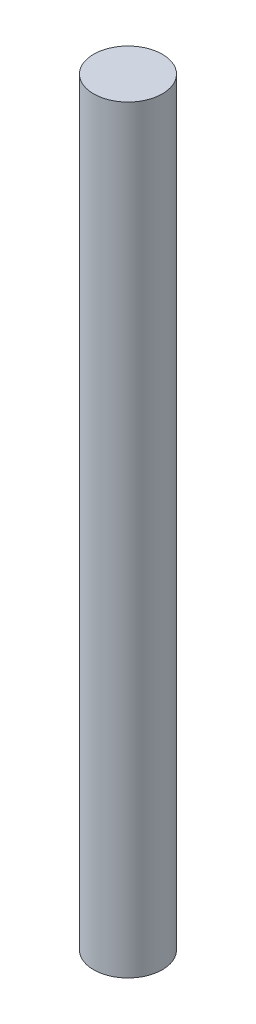
ISO-10303-21;
HEADER;
FILE_DESCRIPTION(('STEP AP214'),'2;1');
FILE_NAME('part.step','',(''),(''),'','','');
FILE_SCHEMA(('AUTOMOTIVE_DESIGN { 1 0 10303 214 1 1 1 1 }'));
ENDSEC;
DATA;
#1=APPLICATION_CONTEXT('core data for automotive mechanical design processes');
#2=APPLICATION_PROTOCOL_DEFINITION('international standard','automotive_design',2000,#1);
#3=PRODUCT_CONTEXT('',#1,'mechanical');
#4=PRODUCT('Part','Part','',(#3));
#5=PRODUCT_RELATED_PRODUCT_CATEGORY('part','',(#4));
#6=PRODUCT_DEFINITION_FORMATION('','',#4);
#7=PRODUCT_DEFINITION_CONTEXT('part definition',#1,'design');
#8=PRODUCT_DEFINITION('design','',#6,#7);
#9=PRODUCT_DEFINITION_SHAPE('','',#8);
#10=(LENGTH_UNIT() NAMED_UNIT(*) SI_UNIT(.MILLI.,.METRE.));
#11=(NAMED_UNIT(*) PLANE_ANGLE_UNIT() SI_UNIT($,.RADIAN.));
#12=(NAMED_UNIT(*) SI_UNIT($,.STERADIAN.) SOLID_ANGLE_UNIT());
#13=UNCERTAINTY_MEASURE_WITH_UNIT(LENGTH_MEASURE(1.E-05),#10,'distance_accuracy_value','');
#14=(GEOMETRIC_REPRESENTATION_CONTEXT(3) GLOBAL_UNCERTAINTY_ASSIGNED_CONTEXT((#13)) GLOBAL_UNIT_ASSIGNED_CONTEXT((#10,
#11,#12)) REPRESENTATION_CONTEXT('',''));
#15=CARTESIAN_POINT('',(0.,0.,0.));
#16=DIRECTION('',(0.,0.,1.));
#17=DIRECTION('',(1.,0.,0.));
#18=AXIS2_PLACEMENT_3D('',#15,#16,#17);
#19=CARTESIAN_POINT('',(-115.343556570741,248.5,-28.368419978005));
#20=DIRECTION('',(0.,-1.,0.));
#21=DIRECTION('',(0.,0.,-1.));
#22=AXIS2_PLACEMENT_3D('',#19,#20,#21);
#23=CYLINDRICAL_SURFACE('',#22,11.25);
#24=CARTESIAN_POINT('',(-115.343556570741,248.5,-28.368419978005));
#25=DIRECTION('',(0.,1.,0.));
#26=DIRECTION('',(0.,0.,1.));
#27=AXIS2_PLACEMENT_3D('',#24,#25,#26);
#28=CIRCLE('',#27,11.25);
#29=CARTESIAN_POINT('',(-115.343556570741,248.5,-17.118419978005));
#30=VERTEX_POINT('',#29);
#31=EDGE_CURVE('E10',#30,#30,#28,.T.);
#32=ORIENTED_EDGE('',*,*,#31,.F.);
#33=EDGE_LOOP('',(#32));
#34=FACE_BOUND('',#33,.T.);
#35=CARTESIAN_POINT('',(-115.343556570741,0.,-28.368419978005));
#36=DIRECTION('',(0.,1.,0.));
#37=DIRECTION('',(0.,0.,1.));
#38=AXIS2_PLACEMENT_3D('',#35,#36,#37);
#39=CIRCLE('',#38,11.25);
#40=CARTESIAN_POINT('',(-115.343556570741,0.,-17.118419978005));
#41=VERTEX_POINT('',#40);
#42=EDGE_CURVE('E46',#41,#41,#39,.T.);
#43=ORIENTED_EDGE('',*,*,#42,.T.);
#44=EDGE_LOOP('',(#43));
#45=FACE_BOUND('',#44,.T.);
#46=ADVANCED_FACE('F43',(#34,#45),#23,.T.);
#47=CARTESIAN_POINT('',(-115.343556570741,248.5,-28.368419978005));
#48=DIRECTION('',(0.,1.,0.));
#49=DIRECTION('',(0.,0.,1.));
#50=AXIS2_PLACEMENT_3D('',#47,#48,#49);
#51=PLANE('',#50);
#52=ORIENTED_EDGE('',*,*,#31,.T.);
#53=EDGE_LOOP('',(#52));
#54=FACE_BOUND('',#53,.T.);
#55=ADVANCED_FACE('F60',(#54),#51,.T.);
#56=CARTESIAN_POINT('',(-115.343556570741,0.,-28.368419978005));
#57=DIRECTION('',(0.,1.,0.));
#58=DIRECTION('',(0.,0.,1.));
#59=AXIS2_PLACEMENT_3D('',#56,#57,#58);
#60=PLANE('',#59);
#61=ORIENTED_EDGE('',*,*,#42,.F.);
#62=EDGE_LOOP('',(#61));
#63=FACE_BOUND('',#62,.T.);
#64=ADVANCED_FACE('F58',(#63),#60,.F.);
#65=CLOSED_SHELL('',(#46,#55,#64));
#66=MANIFOLD_SOLID_BREP('B2',#65);
#67=ADVANCED_BREP_SHAPE_REPRESENTATION('',(#18,#66),#14);
#68=SHAPE_DEFINITION_REPRESENTATION(#9,#67);
ENDSEC;
END-ISO-10303-21;
